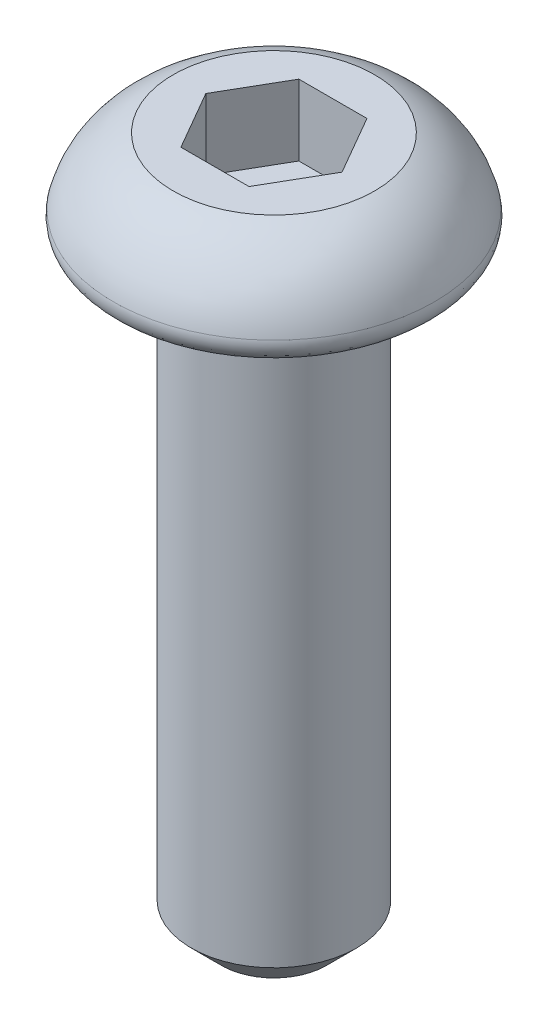
ISO-10303-21;
HEADER;
FILE_DESCRIPTION(('STEP AP214'),'2;1');
FILE_NAME('part.step','',(''),(''),'','','');
FILE_SCHEMA(('AUTOMOTIVE_DESIGN { 1 0 10303 214 1 1 1 1 }'));
ENDSEC;
DATA;
#1=APPLICATION_CONTEXT('core data for automotive mechanical design processes');
#2=APPLICATION_PROTOCOL_DEFINITION('international standard','automotive_design',2000,#1);
#3=PRODUCT_CONTEXT('',#1,'mechanical');
#4=PRODUCT('Part','Part','',(#3));
#5=PRODUCT_RELATED_PRODUCT_CATEGORY('part','',(#4));
#6=PRODUCT_DEFINITION_FORMATION('','',#4);
#7=PRODUCT_DEFINITION_CONTEXT('part definition',#1,'design');
#8=PRODUCT_DEFINITION('design','',#6,#7);
#9=PRODUCT_DEFINITION_SHAPE('','',#8);
#10=(LENGTH_UNIT() NAMED_UNIT(*) SI_UNIT(.MILLI.,.METRE.));
#11=(NAMED_UNIT(*) PLANE_ANGLE_UNIT() SI_UNIT($,.RADIAN.));
#12=(NAMED_UNIT(*) SI_UNIT($,.STERADIAN.) SOLID_ANGLE_UNIT());
#13=UNCERTAINTY_MEASURE_WITH_UNIT(LENGTH_MEASURE(1.E-05),#10,'distance_accuracy_value','');
#14=(GEOMETRIC_REPRESENTATION_CONTEXT(3) GLOBAL_UNCERTAINTY_ASSIGNED_CONTEXT((#13)) GLOBAL_UNIT_ASSIGNED_CONTEXT((#10,
#11,#12)) REPRESENTATION_CONTEXT('',''));
#15=CARTESIAN_POINT('',(0.,0.,0.));
#16=DIRECTION('',(0.,0.,1.));
#17=DIRECTION('',(1.,0.,0.));
#18=AXIS2_PLACEMENT_3D('',#15,#16,#17);
#19=CARTESIAN_POINT('',(0.,0.,0.));
#20=DIRECTION('',(0.,-1.,0.));
#21=DIRECTION('',(1.,0.,0.));
#22=AXIS2_PLACEMENT_3D('',#19,#20,#21);
#23=PLANE('',#22);
#24=CARTESIAN_POINT('',(0.,0.,0.));
#25=DIRECTION('',(0.,-1.,0.));
#26=DIRECTION('',(1.,0.,0.));
#27=AXIS2_PLACEMENT_3D('',#24,#25,#26);
#28=CIRCLE('',#27,1.55575);
#29=CARTESIAN_POINT('',(1.55575,0.,0.));
#30=VERTEX_POINT('',#29);
#31=EDGE_CURVE('E11',#30,#30,#28,.F.);
#32=ORIENTED_EDGE('',*,*,#31,.T.);
#33=EDGE_LOOP('',(#32));
#34=FACE_BOUND('',#33,.T.);
#35=CARTESIAN_POINT('',(0.,0.,0.));
#36=DIRECTION('',(0.,-1.,0.));
#37=DIRECTION('',(1.,0.,0.));
#38=AXIS2_PLACEMENT_3D('',#35,#36,#37);
#39=CIRCLE('',#38,2.23551750220244);
#40=CARTESIAN_POINT('',(2.23551750220243,0.,0.));
#41=VERTEX_POINT('',#40);
#42=EDGE_CURVE('E189',#41,#41,#39,.T.);
#43=ORIENTED_EDGE('',*,*,#42,.T.);
#44=EDGE_LOOP('',(#43));
#45=FACE_BOUND('',#44,.T.);
#46=ADVANCED_FACE('F33',(#34,#45),#23,.T.);
#47=CARTESIAN_POINT('',(0.,-2.05621093332515E-13,0.));
#48=DIRECTION('',(0.,-1.,0.));
#49=DIRECTION('',(1.,0.,0.));
#50=AXIS2_PLACEMENT_3D('',#47,#48,#49);
#51=DEGENERATE_TOROIDAL_SURFACE('',#50,1.0627872742876,1.51609538107768,.T.);
#52=CARTESIAN_POINT('',(0.,1.42239999999994,0.));
#53=DIRECTION('',(0.,-1.,0.));
#54=DIRECTION('',(1.,0.,0.));
#55=AXIS2_PLACEMENT_3D('',#52,#53,#54);
#56=CIRCLE('',#55,1.5875000000001);
#57=CARTESIAN_POINT('',(1.5875000000001,1.42239999999994,0.));
#58=VERTEX_POINT('',#57);
#59=EDGE_CURVE('E185',#58,#58,#56,.T.);
#60=ORIENTED_EDGE('',*,*,#59,.T.);
#61=EDGE_LOOP('',(#60));
#62=FACE_BOUND('',#61,.T.);
#63=CARTESIAN_POINT('',(0.,0.381000000000026,0.));
#64=DIRECTION('',(0.,-1.,0.));
#65=DIRECTION('',(1.,0.,0.));
#66=AXIS2_PLACEMENT_3D('',#63,#64,#65);
#67=CIRCLE('',#66,2.5302286545563);
#68=CARTESIAN_POINT('',(2.5302286545563,0.381000000000027,0.));
#69=VERTEX_POINT('',#68);
#70=EDGE_CURVE('E135',#69,#69,#67,.T.);
#71=ORIENTED_EDGE('',*,*,#70,.F.);
#72=EDGE_LOOP('',(#71));
#73=FACE_BOUND('',#72,.T.);
#74=ADVANCED_FACE('F160',(#62,#73),#51,.T.);
#75=CARTESIAN_POINT('',(1.5875000000001,1.42239999999994,0.));
#76=DIRECTION('',(0.,1.,0.));
#77=DIRECTION('',(-1.,0.,0.));
#78=AXIS2_PLACEMENT_3D('',#75,#76,#77);
#79=PLANE('',#78);
#80=DIRECTION('',(-1.,0.,0.));
#81=VECTOR('',#80,1.);
#82=CARTESIAN_POINT('',(0.536575000000004,1.42239999999974,-0.929375162070902));
#83=LINE('',#82,#81);
#84=CARTESIAN_POINT('',(0.536575000000004,1.42239999999974,-0.929375162070902));
#85=VERTEX_POINT('',#84);
#86=CARTESIAN_POINT('',(-0.536575000000001,1.42239999999994,-0.929375162070899));
#87=VERTEX_POINT('',#86);
#88=EDGE_CURVE('E48',#85,#87,#83,.T.);
#89=ORIENTED_EDGE('',*,*,#88,.F.);
#90=DIRECTION('',(-0.500000000000019,-1.86905280631626E-13,-0.866025403784427));
#91=VECTOR('',#90,1.);
#92=CARTESIAN_POINT('',(1.07314999999999,1.42239999999994,3.04238897189008E-13));
#93=LINE('',#92,#91);
#94=CARTESIAN_POINT('',(1.07314999999999,1.42239999999994,3.04238897189008E-13));
#95=VERTEX_POINT('',#94);
#96=EDGE_CURVE('E131',#95,#85,#93,.T.);
#97=ORIENTED_EDGE('',*,*,#96,.F.);
#98=DIRECTION('',(0.5,-1.87309400157315E-13,-0.866025403784439));
#99=VECTOR('',#98,1.);
#100=CARTESIAN_POINT('',(0.536575000000022,1.42240000000014,0.929375162071526));
#101=LINE('',#100,#99);
#102=CARTESIAN_POINT('',(0.536575000000022,1.42240000000014,0.929375162071526));
#103=VERTEX_POINT('',#102);
#104=EDGE_CURVE('E129',#103,#95,#101,.T.);
#105=ORIENTED_EDGE('',*,*,#104,.F.);
#106=DIRECTION('',(1.,0.,0.));
#107=VECTOR('',#106,1.);
#108=CARTESIAN_POINT('',(-0.536574999999981,1.42240000000014,0.929375162071526));
#109=LINE('',#108,#107);
#110=CARTESIAN_POINT('',(-0.536574999999981,1.42240000000014,0.929375162071526));
#111=VERTEX_POINT('',#110);
#112=EDGE_CURVE('E96',#111,#103,#109,.T.);
#113=ORIENTED_EDGE('',*,*,#112,.F.);
#114=DIRECTION('',(0.500000000000033,1.86905280631622E-13,0.86602540378442));
#115=VECTOR('',#114,1.);
#116=CARTESIAN_POINT('',(-1.07315,1.42239999999994,3.10273403162165E-13));
#117=LINE('',#116,#115);
#118=CARTESIAN_POINT('',(-1.07315,1.42239999999994,3.10273403162165E-13));
#119=VERTEX_POINT('',#118);
#120=EDGE_CURVE('E125',#119,#111,#117,.T.);
#121=ORIENTED_EDGE('',*,*,#120,.F.);
#122=DIRECTION('',(-0.500000000000021,1.87309400157315E-13,0.866025403784426));
#123=VECTOR('',#122,1.);
#124=CARTESIAN_POINT('',(-0.536575000000001,1.42239999999974,-0.929375162070899));
#125=LINE('',#124,#123);
#126=EDGE_CURVE('E122',#87,#119,#125,.T.);
#127=ORIENTED_EDGE('',*,*,#126,.F.);
#128=EDGE_LOOP('',(#89,#97,#105,#113,#121,#127));
#129=FACE_BOUND('',#128,.T.);
#130=ORIENTED_EDGE('',*,*,#59,.F.);
#131=EDGE_LOOP('',(#130));
#132=FACE_BOUND('',#131,.T.);
#133=ADVANCED_FACE('F155',(#129,#132),#79,.T.);
#134=CARTESIAN_POINT('',(2.23551750220243,0.,0.));
#135=CARTESIAN_POINT('',(2.24951033944877,0.,0.));
#136=CARTESIAN_POINT('',(2.26353630436856,0.000969174062968278,0.));
#137=CARTESIAN_POINT('',(2.27739615583798,0.00289375491295665,0.));
#138=CARTESIAN_POINT('',(2.31115111116189,0.00758097257556716,0.));
#139=CARTESIAN_POINT('',(2.34456231315245,0.0181606724187537,0.));
#140=CARTESIAN_POINT('',(2.37486296564608,0.0337567448985861,0.));
#141=CARTESIAN_POINT('',(2.40516361813971,0.0493528173784185,0.));
#142=CARTESIAN_POINT('',(2.43318945054393,0.0703954214301248,0.));
#143=CARTESIAN_POINT('',(2.45661963149209,0.0951420098631324,0.));
#144=CARTESIAN_POINT('',(2.48004981244024,0.11988859829614,0.));
#145=CARTESIAN_POINT('',(2.49953057525176,0.149021712573669,0.));
#146=CARTESIAN_POINT('',(2.51344870948825,0.180128826835698,0.));
#147=CARTESIAN_POINT('',(2.52736684372439,0.211235941096941,0.));
#148=CARTESIAN_POINT('',(2.53610622871251,0.245175027961358,0.));
#149=CARTESIAN_POINT('',(2.53894315218201,0.279135576889569,0.));
#150=CARTESIAN_POINT('',(2.54178007565151,0.31309612581778,0.));
#151=CARTESIAN_POINT('',(2.53879278345438,0.348014810679755,0.));
#152=CARTESIAN_POINT('',(2.5302286545563,0.381000000000027,0.));
#153=B_SPLINE_CURVE_WITH_KNOTS('',3,(#134,#135,#136,#137,#138,#139,#140,#141,#142,#143,#144,
#145,#146,#147,#148,#149,#150,#151,#152),.UNSPECIFIED.,.F.,.F.,(4,3,3,3,3,3,4),(0.,
4.14813639692778E-05,0.000143717869998377,0.000245954376027475,0.000348190882056574,
0.000450427388083017,0.000552663894109461),.UNSPECIFIED.);
#154=CARTESIAN_POINT('',(0.,1.42239999999994,0.));
#155=DIRECTION('',(0.,-1.,0.));
#156=AXIS1_PLACEMENT('',#154,#155);
#157=SURFACE_OF_REVOLUTION('',#153,#156);
#158=ORIENTED_EDGE('',*,*,#70,.T.);
#159=EDGE_LOOP('',(#158));
#160=FACE_BOUND('',#159,.T.);
#161=ORIENTED_EDGE('',*,*,#42,.F.);
#162=EDGE_LOOP('',(#161));
#163=FACE_BOUND('',#162,.T.);
#164=ADVANCED_FACE('F150',(#160,#163),#157,.F.);
#165=CARTESIAN_POINT('',(0.,-9.525,2.05751886278295E-12));
#166=DIRECTION('',(0.,1.,-2.1601247903233E-13));
#167=DIRECTION('',(0.,2.1601247903233E-13,1.));
#168=AXIS2_PLACEMENT_3D('',#165,#166,#167);
#169=CYLINDRICAL_SURFACE('',#168,1.30175);
#170=CARTESIAN_POINT('',(0.,-0.253999999999945,0.));
#171=DIRECTION('',(0.,-1.,0.));
#172=DIRECTION('',(1.,0.,0.));
#173=AXIS2_PLACEMENT_3D('',#170,#171,#172);
#174=CIRCLE('',#173,1.30175);
#175=CARTESIAN_POINT('',(1.30175,-0.253999999999945,0.));
#176=VERTEX_POINT('',#175);
#177=EDGE_CURVE('E41',#176,#176,#174,.T.);
#178=ORIENTED_EDGE('',*,*,#177,.T.);
#179=EDGE_LOOP('',(#178));
#180=FACE_BOUND('',#179,.T.);
#181=CARTESIAN_POINT('',(0.,-9.05255999995929,1.95546592718012E-12));
#182=DIRECTION('',(0.,-1.,2.16012479032331E-13));
#183=DIRECTION('',(0.,-2.16012479032331E-13,-1.));
#184=AXIS2_PLACEMENT_3D('',#181,#182,#183);
#185=CIRCLE('',#184,1.30175);
#186=CARTESIAN_POINT('',(0.,-9.05255999995957,-1.30174999999804));
#187=VERTEX_POINT('',#186);
#188=EDGE_CURVE('E180',#187,#187,#185,.F.);
#189=ORIENTED_EDGE('',*,*,#188,.T.);
#190=EDGE_LOOP('',(#189));
#191=FACE_BOUND('',#190,.T.);
#192=ADVANCED_FACE('F154',(#180,#191),#169,.T.);
#193=CARTESIAN_POINT('',(0.,-9.525,2.05751886278295E-12));
#194=DIRECTION('',(0.,-1.,2.1601247903233E-13));
#195=DIRECTION('',(0.,-2.1601247903233E-13,-1.));
#196=AXIS2_PLACEMENT_3D('',#193,#194,#195);
#197=PLANE('',#196);
#198=CARTESIAN_POINT('',(0.,-9.525,2.05751886278295E-12));
#199=DIRECTION('',(0.,-1.,2.1601247903233E-13));
#200=DIRECTION('',(0.,-2.1601247903233E-13,-1.));
#201=AXIS2_PLACEMENT_3D('',#198,#199,#200);
#202=CIRCLE('',#201,0.829309999959295);
#203=CARTESIAN_POINT('',(0.,-9.52500000000018,-0.829309999957237));
#204=VERTEX_POINT('',#203);
#205=EDGE_CURVE('E183',#204,#204,#202,.T.);
#206=ORIENTED_EDGE('',*,*,#205,.T.);
#207=EDGE_LOOP('',(#206));
#208=FACE_BOUND('',#207,.T.);
#209=ADVANCED_FACE('F197',(#208),#197,.T.);
#210=CARTESIAN_POINT('',(0.536575000000003,0.304799999999743,-0.92937516207066));
#211=DIRECTION('',(0.,-2.1601247903233E-13,-1.));
#212=DIRECTION('',(0.,1.,-2.1601247903233E-13));
#213=AXIS2_PLACEMENT_3D('',#210,#211,#212);
#214=PLANE('',#213);
#215=ORIENTED_EDGE('',*,*,#88,.T.);
#216=DIRECTION('',(0.,1.,-2.1601247903233E-13));
#217=VECTOR('',#216,1.);
#218=CARTESIAN_POINT('',(-0.536575000000001,0.304799999999743,-0.929375162070657));
#219=LINE('',#218,#217);
#220=CARTESIAN_POINT('',(-0.536575000000001,0.304799999999743,-0.929375162070657));
#221=VERTEX_POINT('',#220);
#222=EDGE_CURVE('E78',#221,#87,#219,.T.);
#223=ORIENTED_EDGE('',*,*,#222,.F.);
#224=DIRECTION('',(-1.,0.,0.));
#225=VECTOR('',#224,1.);
#226=CARTESIAN_POINT('',(0.536575000000003,0.304799999999743,-0.92937516207066));
#227=LINE('',#226,#225);
#228=CARTESIAN_POINT('',(0.536575000000003,0.304799999999743,-0.92937516207066));
#229=VERTEX_POINT('',#228);
#230=EDGE_CURVE('E133',#229,#221,#227,.T.);
#231=ORIENTED_EDGE('',*,*,#230,.F.);
#232=DIRECTION('',(0.,1.,-2.1601247903233E-13));
#233=VECTOR('',#232,1.);
#234=CARTESIAN_POINT('',(0.536575000000003,0.304799999999743,-0.92937516207066));
#235=LINE('',#234,#233);
#236=EDGE_CURVE('E56',#229,#85,#235,.T.);
#237=ORIENTED_EDGE('',*,*,#236,.T.);
#238=EDGE_LOOP('',(#215,#223,#231,#237));
#239=FACE_BOUND('',#238,.T.);
#240=ADVANCED_FACE('F201',(#239),#214,.F.);
#241=CARTESIAN_POINT('',(1.07314999999999,0.304799999999944,5.4565444375554E-13));
#242=DIRECTION('',(0.866025403784427,-1.08397458758676E-13,-0.500000000000019));
#243=DIRECTION('',(-0.500000000000019,0.,-0.866025403784428));
#244=AXIS2_PLACEMENT_3D('',#241,#242,#243);
#245=PLANE('',#244);
#246=ORIENTED_EDGE('',*,*,#96,.T.);
#247=ORIENTED_EDGE('',*,*,#236,.F.);
#248=DIRECTION('',(-0.500000000000019,-1.86905280631626E-13,-0.866025403784427));
#249=VECTOR('',#248,1.);
#250=CARTESIAN_POINT('',(1.07314999999999,0.304799999999944,5.4565444375554E-13));
#251=LINE('',#250,#249);
#252=CARTESIAN_POINT('',(1.07314999999999,0.304799999999944,5.4565444375554E-13));
#253=VERTEX_POINT('',#252);
#254=EDGE_CURVE('E108',#253,#229,#251,.T.);
#255=ORIENTED_EDGE('',*,*,#254,.F.);
#256=DIRECTION('',(0.,1.,-2.1601247903233E-13));
#257=VECTOR('',#256,1.);
#258=CARTESIAN_POINT('',(1.07314999999999,0.304799999999944,5.4565444375554E-13));
#259=LINE('',#258,#257);
#260=EDGE_CURVE('E100',#253,#95,#259,.T.);
#261=ORIENTED_EDGE('',*,*,#260,.T.);
#262=EDGE_LOOP('',(#246,#247,#255,#261));
#263=FACE_BOUND('',#262,.T.);
#264=ADVANCED_FACE('F205',(#263),#245,.F.);
#265=CARTESIAN_POINT('',(0.536575000000021,0.304800000000145,0.929375162071768));
#266=DIRECTION('',(0.866025403784438,1.07615020273658E-13,0.5));
#267=DIRECTION('',(0.5,0.,-0.866025403784439));
#268=AXIS2_PLACEMENT_3D('',#265,#266,#267);
#269=PLANE('',#268);
#270=ORIENTED_EDGE('',*,*,#104,.T.);
#271=ORIENTED_EDGE('',*,*,#260,.F.);
#272=DIRECTION('',(0.5,-1.87309400157315E-13,-0.866025403784439));
#273=VECTOR('',#272,1.);
#274=CARTESIAN_POINT('',(0.536575000000021,0.304800000000145,0.929375162071768));
#275=LINE('',#274,#273);
#276=CARTESIAN_POINT('',(0.536575000000021,0.304800000000145,0.929375162071768));
#277=VERTEX_POINT('',#276);
#278=EDGE_CURVE('E104',#277,#253,#275,.T.);
#279=ORIENTED_EDGE('',*,*,#278,.F.);
#280=DIRECTION('',(0.,1.,-2.1601247903233E-13));
#281=VECTOR('',#280,1.);
#282=CARTESIAN_POINT('',(0.536575000000021,0.304800000000145,0.929375162071768));
#283=LINE('',#282,#281);
#284=EDGE_CURVE('E89',#277,#103,#283,.T.);
#285=ORIENTED_EDGE('',*,*,#284,.T.);
#286=EDGE_LOOP('',(#270,#271,#279,#285));
#287=FACE_BOUND('',#286,.T.);
#288=ADVANCED_FACE('F105',(#287),#269,.F.);
#289=CARTESIAN_POINT('',(-0.536574999999981,0.304800000000145,0.929375162071768));
#290=DIRECTION('',(0.,2.1601247903233E-13,1.));
#291=DIRECTION('',(0.,-1.,2.1601247903233E-13));
#292=AXIS2_PLACEMENT_3D('',#289,#290,#291);
#293=PLANE('',#292);
#294=ORIENTED_EDGE('',*,*,#112,.T.);
#295=ORIENTED_EDGE('',*,*,#284,.F.);
#296=DIRECTION('',(1.,0.,0.));
#297=VECTOR('',#296,1.);
#298=CARTESIAN_POINT('',(-0.536574999999981,0.304800000000145,0.929375162071768));
#299=LINE('',#298,#297);
#300=CARTESIAN_POINT('',(-0.536574999999981,0.304800000000145,0.929375162071768));
#301=VERTEX_POINT('',#300);
#302=EDGE_CURVE('E93',#301,#277,#299,.T.);
#303=ORIENTED_EDGE('',*,*,#302,.F.);
#304=DIRECTION('',(0.,1.,-2.1601247903233E-13));
#305=VECTOR('',#304,1.);
#306=CARTESIAN_POINT('',(-0.536574999999981,0.304800000000145,0.929375162071768));
#307=LINE('',#306,#305);
#308=EDGE_CURVE('E101',#301,#111,#307,.T.);
#309=ORIENTED_EDGE('',*,*,#308,.T.);
#310=EDGE_LOOP('',(#294,#295,#303,#309));
#311=FACE_BOUND('',#310,.T.);
#312=ADVANCED_FACE('F91',(#311),#293,.F.);
#313=CARTESIAN_POINT('',(-1.07315,0.304799999999945,5.51688949728698E-13));
#314=DIRECTION('',(-0.86602540378442,1.08397458758679E-13,0.500000000000033));
#315=DIRECTION('',(0.500000000000033,0.,0.86602540378442));
#316=AXIS2_PLACEMENT_3D('',#313,#314,#315);
#317=PLANE('',#316);
#318=ORIENTED_EDGE('',*,*,#120,.T.);
#319=ORIENTED_EDGE('',*,*,#308,.F.);
#320=DIRECTION('',(0.500000000000033,1.86905280631622E-13,0.86602540378442));
#321=VECTOR('',#320,1.);
#322=CARTESIAN_POINT('',(-1.07315,0.304799999999945,5.51688949728698E-13));
#323=LINE('',#322,#321);
#324=CARTESIAN_POINT('',(-1.07315,0.304799999999945,5.51688949728698E-13));
#325=VERTEX_POINT('',#324);
#326=EDGE_CURVE('E114',#325,#301,#323,.T.);
#327=ORIENTED_EDGE('',*,*,#326,.F.);
#328=DIRECTION('',(0.,1.,-2.1601247903233E-13));
#329=VECTOR('',#328,1.);
#330=CARTESIAN_POINT('',(-1.07315,0.304799999999945,5.51688949728698E-13));
#331=LINE('',#330,#329);
#332=EDGE_CURVE('E138',#325,#119,#331,.T.);
#333=ORIENTED_EDGE('',*,*,#332,.T.);
#334=EDGE_LOOP('',(#318,#319,#327,#333));
#335=FACE_BOUND('',#334,.T.);
#336=ADVANCED_FACE('F210',(#335),#317,.F.);
#337=CARTESIAN_POINT('',(-0.536575000000001,0.304799999999743,-0.929375162070657));
#338=DIRECTION('',(-0.866025403784426,-1.07615020273663E-13,-0.500000000000021));
#339=DIRECTION('',(-0.500000000000021,0.,0.866025403784426));
#340=AXIS2_PLACEMENT_3D('',#337,#338,#339);
#341=PLANE('',#340);
#342=ORIENTED_EDGE('',*,*,#126,.T.);
#343=ORIENTED_EDGE('',*,*,#332,.F.);
#344=DIRECTION('',(-0.500000000000021,1.87309400157315E-13,0.866025403784426));
#345=VECTOR('',#344,1.);
#346=CARTESIAN_POINT('',(-0.536575000000001,0.304799999999743,-0.929375162070657));
#347=LINE('',#346,#345);
#348=EDGE_CURVE('E116',#221,#325,#347,.T.);
#349=ORIENTED_EDGE('',*,*,#348,.F.);
#350=ORIENTED_EDGE('',*,*,#222,.T.);
#351=EDGE_LOOP('',(#342,#343,#349,#350));
#352=FACE_BOUND('',#351,.T.);
#353=ADVANCED_FACE('F175',(#352),#341,.F.);
#354=CARTESIAN_POINT('',(0.,0.304799999999944,0.));
#355=DIRECTION('',(0.,1.,-2.16052946688208E-13));
#356=DIRECTION('',(0.,2.16052946688208E-13,1.));
#357=AXIS2_PLACEMENT_3D('',#354,#355,#356);
#358=PLANE('',#357);
#359=ORIENTED_EDGE('',*,*,#230,.T.);
#360=ORIENTED_EDGE('',*,*,#348,.T.);
#361=ORIENTED_EDGE('',*,*,#326,.T.);
#362=ORIENTED_EDGE('',*,*,#302,.T.);
#363=ORIENTED_EDGE('',*,*,#278,.T.);
#364=ORIENTED_EDGE('',*,*,#254,.T.);
#365=EDGE_LOOP('',(#359,#360,#361,#362,#363,#364));
#366=FACE_BOUND('',#365,.T.);
#367=ADVANCED_FACE('F111',(#366),#358,.T.);
#368=CARTESIAN_POINT('',(0.,-9.525,2.05751886278295E-12));
#369=DIRECTION('',(0.,1.,-2.16012479032331E-13));
#370=DIRECTION('',(0.,2.16012479032331E-13,1.));
#371=AXIS2_PLACEMENT_3D('',#368,#369,#370);
#372=CONICAL_SURFACE('',#371,0.829309999959295,0.785398163397445);
#373=ORIENTED_EDGE('',*,*,#188,.F.);
#374=EDGE_LOOP('',(#373));
#375=FACE_BOUND('',#374,.T.);
#376=ORIENTED_EDGE('',*,*,#205,.F.);
#377=EDGE_LOOP('',(#376));
#378=FACE_BOUND('',#377,.T.);
#379=ADVANCED_FACE('F167',(#375,#378),#372,.T.);
#380=CARTESIAN_POINT('',(0.,-0.254000000000001,0.));
#381=DIRECTION('',(0.,-1.,0.));
#382=DIRECTION('',(1.,0.,0.));
#383=AXIS2_PLACEMENT_3D('',#380,#381,#382);
#384=TOROIDAL_SURFACE('',#383,1.55575,0.254);
#385=ORIENTED_EDGE('',*,*,#31,.F.);
#386=EDGE_LOOP('',(#385));
#387=FACE_BOUND('',#386,.T.);
#388=ORIENTED_EDGE('',*,*,#177,.F.);
#389=EDGE_LOOP('',(#388));
#390=FACE_BOUND('',#389,.T.);
#391=ADVANCED_FACE('F35',(#387,#390),#384,.F.);
#392=CLOSED_SHELL('',(#46,#74,#133,#164,#192,#209,#240,#264,#288,#312,#336,#353,#367,#379,#391));
#393=MANIFOLD_SOLID_BREP('B2',#392);
#394=ADVANCED_BREP_SHAPE_REPRESENTATION('',(#18,#393),#14);
#395=SHAPE_DEFINITION_REPRESENTATION(#9,#394);
ENDSEC;
END-ISO-10303-21;
